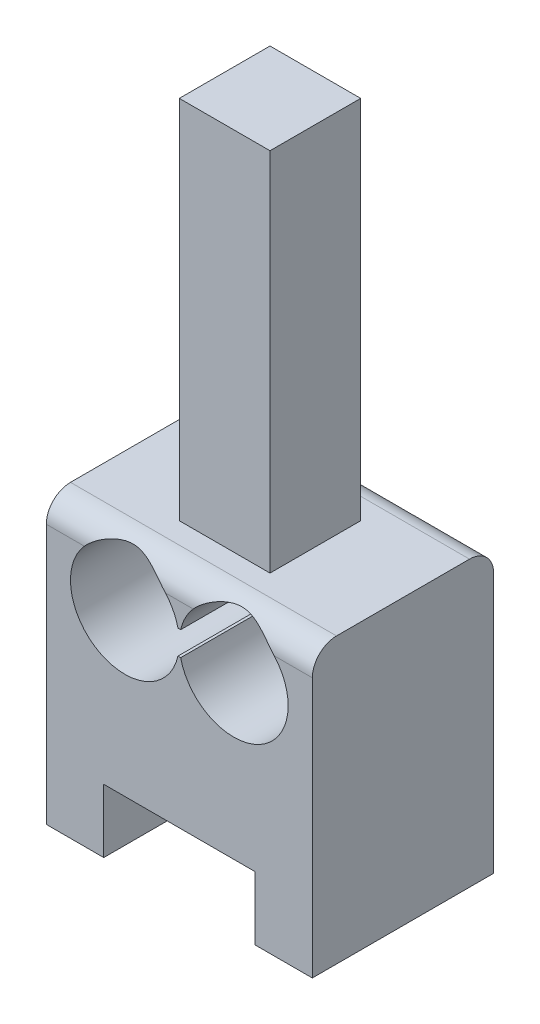
ISO-10303-21;
HEADER;
FILE_DESCRIPTION(('STEP AP214'),'2;1');
FILE_NAME('part.step','',(''),(''),'','','');
FILE_SCHEMA(('AUTOMOTIVE_DESIGN { 1 0 10303 214 1 1 1 1 }'));
ENDSEC;
DATA;
#1=APPLICATION_CONTEXT('core data for automotive mechanical design processes');
#2=APPLICATION_PROTOCOL_DEFINITION('international standard','automotive_design',2000,#1);
#3=PRODUCT_CONTEXT('',#1,'mechanical');
#4=PRODUCT('Part','Part','',(#3));
#5=PRODUCT_RELATED_PRODUCT_CATEGORY('part','',(#4));
#6=PRODUCT_DEFINITION_FORMATION('','',#4);
#7=PRODUCT_DEFINITION_CONTEXT('part definition',#1,'design');
#8=PRODUCT_DEFINITION('design','',#6,#7);
#9=PRODUCT_DEFINITION_SHAPE('','',#8);
#10=(LENGTH_UNIT() NAMED_UNIT(*) SI_UNIT(.MILLI.,.METRE.));
#11=(NAMED_UNIT(*) PLANE_ANGLE_UNIT() SI_UNIT($,.RADIAN.));
#12=(NAMED_UNIT(*) SI_UNIT($,.STERADIAN.) SOLID_ANGLE_UNIT());
#13=UNCERTAINTY_MEASURE_WITH_UNIT(LENGTH_MEASURE(1.E-05),#10,'distance_accuracy_value','');
#14=(GEOMETRIC_REPRESENTATION_CONTEXT(3) GLOBAL_UNCERTAINTY_ASSIGNED_CONTEXT((#13)) GLOBAL_UNIT_ASSIGNED_CONTEXT((#10,
#11,#12)) REPRESENTATION_CONTEXT('',''));
#15=CARTESIAN_POINT('',(0.,0.,0.));
#16=DIRECTION('',(0.,0.,1.));
#17=DIRECTION('',(1.,0.,0.));
#18=AXIS2_PLACEMENT_3D('',#15,#16,#17);
#19=CARTESIAN_POINT('',(0.,0.,15.));
#20=DIRECTION('',(0.,0.,1.));
#21=DIRECTION('',(1.,0.,0.));
#22=AXIS2_PLACEMENT_3D('',#19,#20,#21);
#23=PLANE('',#22);
#24=DIRECTION('',(0.,-1.,0.));
#25=VECTOR('',#24,1.);
#26=CARTESIAN_POINT('',(59.1668994407689,0.,15.));
#27=LINE('',#26,#25);
#28=CARTESIAN_POINT('',(59.1668994407689,-47.8774777520744,15.));
#29=VERTEX_POINT('',#28);
#30=CARTESIAN_POINT('',(59.166899440769,-69.3774777520745,15.));
#31=VERTEX_POINT('',#30);
#32=EDGE_CURVE('E257',#29,#31,#27,.T.);
#33=ORIENTED_EDGE('',*,*,#32,.F.);
#34=DIRECTION('',(1.,0.,0.));
#35=VECTOR('',#34,1.);
#36=CARTESIAN_POINT('',(0.,-47.8774777520745,15.));
#37=LINE('',#36,#35);
#38=CARTESIAN_POINT('',(56.0210014070186,-47.8774777520745,15.));
#39=VERTEX_POINT('',#38);
#40=EDGE_CURVE('E11',#29,#39,#37,.F.);
#41=ORIENTED_EDGE('',*,*,#40,.T.);
#42=CARTESIAN_POINT('',(52.6668994407689,-50.8774777520745,15.));
#43=DIRECTION('',(0.,0.,1.));
#44=DIRECTION('',(1.,0.,0.));
#45=AXIS2_PLACEMENT_3D('',#42,#43,#44);
#46=CIRCLE('',#45,4.50000000000001);
#47=CARTESIAN_POINT('',(48.2794172470729,-51.8774777520744,15.));
#48=VERTEX_POINT('',#47);
#49=EDGE_CURVE('E251',#48,#39,#46,.T.);
#50=ORIENTED_EDGE('',*,*,#49,.F.);
#51=DIRECTION('',(1.,0.,0.));
#52=VECTOR('',#51,1.);
#53=CARTESIAN_POINT('',(0.,-51.8774777520744,15.));
#54=LINE('',#53,#52);
#55=CARTESIAN_POINT('',(48.054381634465,-51.8774777520744,15.));
#56=VERTEX_POINT('',#55);
#57=EDGE_CURVE('E254',#56,#48,#54,.T.);
#58=ORIENTED_EDGE('',*,*,#57,.F.);
#59=CARTESIAN_POINT('',(43.6668994407689,-50.8774777520744,15.));
#60=DIRECTION('',(0.,0.,1.));
#61=DIRECTION('',(1.,0.,0.));
#62=AXIS2_PLACEMENT_3D('',#59,#60,#61);
#63=CIRCLE('',#62,4.5);
#64=CARTESIAN_POINT('',(40.3127974745193,-47.8774777520745,15.));
#65=VERTEX_POINT('',#64);
#66=EDGE_CURVE('E247',#65,#56,#63,.T.);
#67=ORIENTED_EDGE('',*,*,#66,.F.);
#68=DIRECTION('',(1.,0.,0.));
#69=VECTOR('',#68,1.);
#70=CARTESIAN_POINT('',(0.,-47.8774777520745,15.));
#71=LINE('',#70,#69);
#72=CARTESIAN_POINT('',(37.1668994407689,-47.8774777520745,15.));
#73=VERTEX_POINT('',#72);
#74=EDGE_CURVE('E59',#65,#73,#71,.F.);
#75=ORIENTED_EDGE('',*,*,#74,.T.);
#76=DIRECTION('',(0.,-1.,0.));
#77=VECTOR('',#76,1.);
#78=CARTESIAN_POINT('',(37.1668994407689,0.,15.));
#79=LINE('',#78,#77);
#80=CARTESIAN_POINT('',(37.1668994407689,-69.3774777520745,15.));
#81=VERTEX_POINT('',#80);
#82=EDGE_CURVE('E259',#73,#81,#79,.T.);
#83=ORIENTED_EDGE('',*,*,#82,.T.);
#84=DIRECTION('',(-1.,0.,0.));
#85=VECTOR('',#84,1.);
#86=CARTESIAN_POINT('',(0.,-69.3774777520745,15.));
#87=LINE('',#86,#85);
#88=CARTESIAN_POINT('',(41.9168994407689,-69.3774777520745,15.));
#89=VERTEX_POINT('',#88);
#90=EDGE_CURVE('E261',#89,#81,#87,.T.);
#91=ORIENTED_EDGE('',*,*,#90,.F.);
#92=DIRECTION('',(0.,-1.,0.));
#93=VECTOR('',#92,1.);
#94=CARTESIAN_POINT('',(41.9168994407689,0.,15.));
#95=LINE('',#94,#93);
#96=CARTESIAN_POINT('',(41.9168994407689,-64.1274777520745,15.));
#97=VERTEX_POINT('',#96);
#98=EDGE_CURVE('E264',#97,#89,#95,.T.);
#99=ORIENTED_EDGE('',*,*,#98,.F.);
#100=DIRECTION('',(1.,0.,0.));
#101=VECTOR('',#100,1.);
#102=CARTESIAN_POINT('',(0.,-64.1274777520745,15.));
#103=LINE('',#102,#101);
#104=CARTESIAN_POINT('',(54.4168994407689,-64.1274777520745,15.));
#105=VERTEX_POINT('',#104);
#106=EDGE_CURVE('E268',#97,#105,#103,.T.);
#107=ORIENTED_EDGE('',*,*,#106,.T.);
#108=DIRECTION('',(0.,-1.,0.));
#109=VECTOR('',#108,1.);
#110=CARTESIAN_POINT('',(54.4168994407689,0.,15.));
#111=LINE('',#110,#109);
#112=CARTESIAN_POINT('',(54.4168994407689,-69.3774777520745,15.));
#113=VERTEX_POINT('',#112);
#114=EDGE_CURVE('E271',#105,#113,#111,.T.);
#115=ORIENTED_EDGE('',*,*,#114,.T.);
#116=EDGE_CURVE('E265',#31,#113,#87,.T.);
#117=ORIENTED_EDGE('',*,*,#116,.F.);
#118=EDGE_LOOP('',(#33,#41,#50,#58,#67,#75,#83,#91,#99,#107,#115,#117));
#119=FACE_BOUND('',#118,.T.);
#120=ADVANCED_FACE('F43',(#119),#23,.T.);
#121=CARTESIAN_POINT('',(0.,0.,0.));
#122=DIRECTION('',(0.,0.,1.));
#123=DIRECTION('',(1.,0.,0.));
#124=AXIS2_PLACEMENT_3D('',#121,#122,#123);
#125=PLANE('',#124);
#126=DIRECTION('',(0.,-1.,0.));
#127=VECTOR('',#126,1.);
#128=CARTESIAN_POINT('',(37.1668994407689,0.,0.));
#129=LINE('',#128,#127);
#130=CARTESIAN_POINT('',(37.1668994407689,-47.8774777520745,0.));
#131=VERTEX_POINT('',#130);
#132=CARTESIAN_POINT('',(37.1668994407689,-69.3774777520745,0.));
#133=VERTEX_POINT('',#132);
#134=EDGE_CURVE('E288',#131,#133,#129,.T.);
#135=ORIENTED_EDGE('',*,*,#134,.F.);
#136=DIRECTION('',(1.,0.,0.));
#137=VECTOR('',#136,1.);
#138=CARTESIAN_POINT('',(59.1668994407689,-47.8774777520744,0.));
#139=LINE('',#138,#137);
#140=CARTESIAN_POINT('',(40.3127974745193,-47.8774777520745,0.));
#141=VERTEX_POINT('',#140);
#142=EDGE_CURVE('E336',#131,#141,#139,.T.);
#143=ORIENTED_EDGE('',*,*,#142,.T.);
#144=CARTESIAN_POINT('',(43.6668994407689,-50.8774777520744,0.));
#145=DIRECTION('',(0.,0.,1.));
#146=DIRECTION('',(1.,0.,0.));
#147=AXIS2_PLACEMENT_3D('',#144,#145,#146);
#148=CIRCLE('',#147,4.5);
#149=CARTESIAN_POINT('',(48.054381634465,-51.8774777520744,0.));
#150=VERTEX_POINT('',#149);
#151=EDGE_CURVE('E240',#141,#150,#148,.T.);
#152=ORIENTED_EDGE('',*,*,#151,.T.);
#153=DIRECTION('',(1.,0.,0.));
#154=VECTOR('',#153,1.);
#155=CARTESIAN_POINT('',(0.,-51.8774777520744,0.));
#156=LINE('',#155,#154);
#157=CARTESIAN_POINT('',(48.2794172470729,-51.8774777520744,0.));
#158=VERTEX_POINT('',#157);
#159=EDGE_CURVE('E283',#150,#158,#156,.T.);
#160=ORIENTED_EDGE('',*,*,#159,.T.);
#161=CARTESIAN_POINT('',(52.6668994407689,-50.8774777520745,0.));
#162=DIRECTION('',(0.,0.,1.));
#163=DIRECTION('',(1.,0.,0.));
#164=AXIS2_PLACEMENT_3D('',#161,#162,#163);
#165=CIRCLE('',#164,4.50000000000001);
#166=CARTESIAN_POINT('',(56.0210014070186,-47.8774777520745,0.));
#167=VERTEX_POINT('',#166);
#168=EDGE_CURVE('E280',#158,#167,#165,.T.);
#169=ORIENTED_EDGE('',*,*,#168,.T.);
#170=DIRECTION('',(1.,0.,0.));
#171=VECTOR('',#170,1.);
#172=CARTESIAN_POINT('',(59.1668994407689,-47.8774777520744,0.));
#173=LINE('',#172,#171);
#174=CARTESIAN_POINT('',(59.1668994407689,-47.8774777520744,0.));
#175=VERTEX_POINT('',#174);
#176=EDGE_CURVE('E323',#167,#175,#173,.T.);
#177=ORIENTED_EDGE('',*,*,#176,.T.);
#178=DIRECTION('',(0.,-1.,0.));
#179=VECTOR('',#178,1.);
#180=CARTESIAN_POINT('',(59.1668994407689,0.,0.));
#181=LINE('',#180,#179);
#182=CARTESIAN_POINT('',(59.166899440769,-69.3774777520745,0.));
#183=VERTEX_POINT('',#182);
#184=EDGE_CURVE('E286',#175,#183,#181,.T.);
#185=ORIENTED_EDGE('',*,*,#184,.T.);
#186=DIRECTION('',(-1.,0.,0.));
#187=VECTOR('',#186,1.);
#188=CARTESIAN_POINT('',(0.,-69.3774777520745,0.));
#189=LINE('',#188,#187);
#190=CARTESIAN_POINT('',(54.4168994407689,-69.3774777520745,0.));
#191=VERTEX_POINT('',#190);
#192=EDGE_CURVE('E294',#183,#191,#189,.T.);
#193=ORIENTED_EDGE('',*,*,#192,.T.);
#194=DIRECTION('',(0.,-1.,0.));
#195=VECTOR('',#194,1.);
#196=CARTESIAN_POINT('',(54.4168994407689,0.,0.));
#197=LINE('',#196,#195);
#198=CARTESIAN_POINT('',(54.4168994407689,-64.1274777520745,0.));
#199=VERTEX_POINT('',#198);
#200=EDGE_CURVE('E300',#199,#191,#197,.T.);
#201=ORIENTED_EDGE('',*,*,#200,.F.);
#202=DIRECTION('',(1.,0.,0.));
#203=VECTOR('',#202,1.);
#204=CARTESIAN_POINT('',(0.,-64.1274777520745,0.));
#205=LINE('',#204,#203);
#206=CARTESIAN_POINT('',(41.9168994407689,-64.1274777520745,0.));
#207=VERTEX_POINT('',#206);
#208=EDGE_CURVE('E297',#207,#199,#205,.T.);
#209=ORIENTED_EDGE('',*,*,#208,.F.);
#210=DIRECTION('',(0.,-1.,0.));
#211=VECTOR('',#210,1.);
#212=CARTESIAN_POINT('',(41.9168994407689,0.,0.));
#213=LINE('',#212,#211);
#214=CARTESIAN_POINT('',(41.9168994407689,-69.3774777520745,0.));
#215=VERTEX_POINT('',#214);
#216=EDGE_CURVE('E293',#207,#215,#213,.T.);
#217=ORIENTED_EDGE('',*,*,#216,.T.);
#218=EDGE_CURVE('E290',#215,#133,#189,.T.);
#219=ORIENTED_EDGE('',*,*,#218,.T.);
#220=EDGE_LOOP('',(#135,#143,#152,#160,#169,#177,#185,#193,#201,#209,#217,#219));
#221=FACE_BOUND('',#220,.T.);
#222=ADVANCED_FACE('F399',(#221),#125,.F.);
#223=CARTESIAN_POINT('',(0.,-45.8774777520745,15.));
#224=DIRECTION('',(0.,1.,0.));
#225=DIRECTION('',(-1.,0.,0.));
#226=AXIS2_PLACEMENT_3D('',#223,#224,#225);
#227=PLANE('',#226);
#228=DIRECTION('',(0.,0.,-1.));
#229=VECTOR('',#228,1.);
#230=CARTESIAN_POINT('',(59.1668994407689,-45.8774777520744,15.));
#231=LINE('',#230,#229);
#232=CARTESIAN_POINT('',(59.1668994407689,-45.8774777520744,13.));
#233=VERTEX_POINT('',#232);
#234=CARTESIAN_POINT('',(59.1668994407689,-45.8774777520744,2.));
#235=VERTEX_POINT('',#234);
#236=EDGE_CURVE('E321',#233,#235,#231,.T.);
#237=ORIENTED_EDGE('',*,*,#236,.T.);
#238=DIRECTION('',(1.,0.,0.));
#239=VECTOR('',#238,1.);
#240=CARTESIAN_POINT('',(37.1668994407689,-45.8774777520745,2.));
#241=LINE('',#240,#239);
#242=CARTESIAN_POINT('',(37.1668994407689,-45.8774777520744,2.));
#243=VERTEX_POINT('',#242);
#244=EDGE_CURVE('E67',#235,#243,#241,.F.);
#245=ORIENTED_EDGE('',*,*,#244,.T.);
#246=DIRECTION('',(0.,0.,-1.));
#247=VECTOR('',#246,1.);
#248=CARTESIAN_POINT('',(37.1668994407689,-45.8774777520744,15.));
#249=LINE('',#248,#247);
#250=CARTESIAN_POINT('',(37.1668994407689,-45.8774777520744,13.));
#251=VERTEX_POINT('',#250);
#252=EDGE_CURVE('E319',#251,#243,#249,.T.);
#253=ORIENTED_EDGE('',*,*,#252,.F.);
#254=DIRECTION('',(1.,0.,0.));
#255=VECTOR('',#254,1.);
#256=CARTESIAN_POINT('',(0.,-45.8774777520745,13.));
#257=LINE('',#256,#255);
#258=EDGE_CURVE('E492',#251,#233,#257,.T.);
#259=ORIENTED_EDGE('',*,*,#258,.T.);
#260=EDGE_LOOP('',(#237,#245,#253,#259));
#261=FACE_BOUND('',#260,.T.);
#262=DIRECTION('',(0.,0.,-1.));
#263=VECTOR('',#262,1.);
#264=CARTESIAN_POINT('',(44.4168994407689,-45.8774777520744,11.25));
#265=LINE('',#264,#263);
#266=CARTESIAN_POINT('',(44.4168994407689,-45.8774777520744,11.25));
#267=VERTEX_POINT('',#266);
#268=CARTESIAN_POINT('',(44.4168994407689,-45.8774777520744,3.75));
#269=VERTEX_POINT('',#268);
#270=EDGE_CURVE('E195',#267,#269,#265,.T.);
#271=ORIENTED_EDGE('',*,*,#270,.T.);
#272=DIRECTION('',(1.,0.,0.));
#273=VECTOR('',#272,1.);
#274=CARTESIAN_POINT('',(0.,-45.8774777520744,3.75));
#275=LINE('',#274,#273);
#276=CARTESIAN_POINT('',(51.916899440769,-45.8774777520744,3.75));
#277=VERTEX_POINT('',#276);
#278=EDGE_CURVE('E226',#269,#277,#275,.T.);
#279=ORIENTED_EDGE('',*,*,#278,.T.);
#280=DIRECTION('',(0.,0.,-1.));
#281=VECTOR('',#280,1.);
#282=CARTESIAN_POINT('',(51.916899440769,-45.8774777520744,11.25));
#283=LINE('',#282,#281);
#284=CARTESIAN_POINT('',(51.916899440769,-45.8774777520744,11.25));
#285=VERTEX_POINT('',#284);
#286=EDGE_CURVE('E206',#285,#277,#283,.T.);
#287=ORIENTED_EDGE('',*,*,#286,.F.);
#288=DIRECTION('',(1.,0.,0.));
#289=VECTOR('',#288,1.);
#290=CARTESIAN_POINT('',(0.,-45.8774777520744,11.25));
#291=LINE('',#290,#289);
#292=EDGE_CURVE('E210',#267,#285,#291,.T.);
#293=ORIENTED_EDGE('',*,*,#292,.F.);
#294=EDGE_LOOP('',(#271,#279,#287,#293));
#295=FACE_BOUND('',#294,.T.);
#296=ADVANCED_FACE('F218',(#261,#295),#227,.T.);
#297=CARTESIAN_POINT('',(59.1668994407689,0.,15.));
#298=DIRECTION('',(1.,0.,0.));
#299=DIRECTION('',(0.,1.,0.));
#300=AXIS2_PLACEMENT_3D('',#297,#298,#299);
#301=PLANE('',#300);
#302=ORIENTED_EDGE('',*,*,#184,.F.);
#303=CARTESIAN_POINT('',(59.1668994407689,-47.8774777520744,2.));
#304=DIRECTION('',(1.,0.,0.));
#305=DIRECTION('',(0.,1.,0.));
#306=AXIS2_PLACEMENT_3D('',#303,#304,#305);
#307=CIRCLE('',#306,2.);
#308=EDGE_CURVE('E493',#175,#235,#307,.T.);
#309=ORIENTED_EDGE('',*,*,#308,.T.);
#310=ORIENTED_EDGE('',*,*,#236,.F.);
#311=CARTESIAN_POINT('',(59.1668994407689,-47.8774777520744,13.));
#312=DIRECTION('',(1.,0.,0.));
#313=DIRECTION('',(0.,1.,0.));
#314=AXIS2_PLACEMENT_3D('',#311,#312,#313);
#315=CIRCLE('',#314,2.);
#316=EDGE_CURVE('E374',#233,#29,#315,.T.);
#317=ORIENTED_EDGE('',*,*,#316,.T.);
#318=ORIENTED_EDGE('',*,*,#32,.T.);
#319=DIRECTION('',(0.,0.,-1.));
#320=VECTOR('',#319,1.);
#321=CARTESIAN_POINT('',(59.166899440769,-69.3774777520745,15.));
#322=LINE('',#321,#320);
#323=EDGE_CURVE('E303',#31,#183,#322,.T.);
#324=ORIENTED_EDGE('',*,*,#323,.T.);
#325=EDGE_LOOP('',(#302,#309,#310,#317,#318,#324));
#326=FACE_BOUND('',#325,.T.);
#327=ADVANCED_FACE('F392',(#326),#301,.T.);
#328=CARTESIAN_POINT('',(37.1668994407689,0.,15.));
#329=DIRECTION('',(1.,0.,0.));
#330=DIRECTION('',(0.,0.,-1.));
#331=AXIS2_PLACEMENT_3D('',#328,#329,#330);
#332=PLANE('',#331);
#333=ORIENTED_EDGE('',*,*,#252,.T.);
#334=CARTESIAN_POINT('',(37.1668994407689,-47.8774777520745,2.));
#335=DIRECTION('',(1.,0.,0.));
#336=DIRECTION('',(0.,0.,-1.));
#337=AXIS2_PLACEMENT_3D('',#334,#335,#336);
#338=CIRCLE('',#337,2.);
#339=EDGE_CURVE('E486',#243,#131,#338,.F.);
#340=ORIENTED_EDGE('',*,*,#339,.T.);
#341=ORIENTED_EDGE('',*,*,#134,.T.);
#342=DIRECTION('',(0.,0.,-1.));
#343=VECTOR('',#342,1.);
#344=CARTESIAN_POINT('',(37.1668994407689,-69.3774777520745,15.));
#345=LINE('',#344,#343);
#346=EDGE_CURVE('E316',#81,#133,#345,.T.);
#347=ORIENTED_EDGE('',*,*,#346,.F.);
#348=ORIENTED_EDGE('',*,*,#82,.F.);
#349=CARTESIAN_POINT('',(37.1668994407689,-47.8774777520745,13.));
#350=DIRECTION('',(1.,0.,0.));
#351=DIRECTION('',(0.,0.,-1.));
#352=AXIS2_PLACEMENT_3D('',#349,#350,#351);
#353=CIRCLE('',#352,2.);
#354=EDGE_CURVE('E485',#73,#251,#353,.F.);
#355=ORIENTED_EDGE('',*,*,#354,.T.);
#356=EDGE_LOOP('',(#333,#340,#341,#347,#348,#355));
#357=FACE_BOUND('',#356,.T.);
#358=ADVANCED_FACE('F395',(#357),#332,.F.);
#359=CARTESIAN_POINT('',(0.,-69.3774777520745,15.));
#360=DIRECTION('',(0.,-1.,0.));
#361=DIRECTION('',(1.,0.,0.));
#362=AXIS2_PLACEMENT_3D('',#359,#360,#361);
#363=PLANE('',#362);
#364=ORIENTED_EDGE('',*,*,#218,.F.);
#365=DIRECTION('',(0.,0.,-1.));
#366=VECTOR('',#365,1.);
#367=CARTESIAN_POINT('',(41.9168994407689,-69.3774777520745,15.));
#368=LINE('',#367,#366);
#369=EDGE_CURVE('E314',#89,#215,#368,.T.);
#370=ORIENTED_EDGE('',*,*,#369,.F.);
#371=ORIENTED_EDGE('',*,*,#90,.T.);
#372=ORIENTED_EDGE('',*,*,#346,.T.);
#373=EDGE_LOOP('',(#364,#370,#371,#372));
#374=FACE_BOUND('',#373,.T.);
#375=ADVANCED_FACE('F402',(#374),#363,.T.);
#376=CARTESIAN_POINT('',(41.9168994407689,0.,15.));
#377=DIRECTION('',(1.,0.,0.));
#378=DIRECTION('',(0.,0.,-1.));
#379=AXIS2_PLACEMENT_3D('',#376,#377,#378);
#380=PLANE('',#379);
#381=ORIENTED_EDGE('',*,*,#216,.F.);
#382=DIRECTION('',(0.,0.,-1.));
#383=VECTOR('',#382,1.);
#384=CARTESIAN_POINT('',(41.9168994407689,-64.1274777520745,15.));
#385=LINE('',#384,#383);
#386=EDGE_CURVE('E312',#97,#207,#385,.T.);
#387=ORIENTED_EDGE('',*,*,#386,.F.);
#388=ORIENTED_EDGE('',*,*,#98,.T.);
#389=ORIENTED_EDGE('',*,*,#369,.T.);
#390=EDGE_LOOP('',(#381,#387,#388,#389));
#391=FACE_BOUND('',#390,.T.);
#392=ADVANCED_FACE('F404',(#391),#380,.T.);
#393=CARTESIAN_POINT('',(0.,-64.1274777520745,15.));
#394=DIRECTION('',(0.,1.,0.));
#395=DIRECTION('',(0.,0.,1.));
#396=AXIS2_PLACEMENT_3D('',#393,#394,#395);
#397=PLANE('',#396);
#398=CARTESIAN_POINT('',(48.166899440769,-64.1274777520745,7.5));
#399=DIRECTION('',(0.,-1.,0.));
#400=DIRECTION('',(0.,0.,-1.));
#401=AXIS2_PLACEMENT_3D('',#398,#399,#400);
#402=CIRCLE('',#401,1.95);
#403=CARTESIAN_POINT('',(48.166899440769,-64.1274777520745,5.55));
#404=VERTEX_POINT('',#403);
#405=EDGE_CURVE('E205',#404,#404,#402,.T.);
#406=ORIENTED_EDGE('',*,*,#405,.F.);
#407=EDGE_LOOP('',(#406));
#408=FACE_BOUND('',#407,.T.);
#409=ORIENTED_EDGE('',*,*,#208,.T.);
#410=DIRECTION('',(0.,0.,-1.));
#411=VECTOR('',#410,1.);
#412=CARTESIAN_POINT('',(54.4168994407689,-64.1274777520745,15.));
#413=LINE('',#412,#411);
#414=EDGE_CURVE('E309',#105,#199,#413,.T.);
#415=ORIENTED_EDGE('',*,*,#414,.F.);
#416=ORIENTED_EDGE('',*,*,#106,.F.);
#417=ORIENTED_EDGE('',*,*,#386,.T.);
#418=EDGE_LOOP('',(#409,#415,#416,#417));
#419=FACE_BOUND('',#418,.T.);
#420=ADVANCED_FACE('F407',(#408,#419),#397,.F.);
#421=CARTESIAN_POINT('',(54.4168994407689,0.,15.));
#422=DIRECTION('',(1.,0.,0.));
#423=DIRECTION('',(0.,0.,-1.));
#424=AXIS2_PLACEMENT_3D('',#421,#422,#423);
#425=PLANE('',#424);
#426=ORIENTED_EDGE('',*,*,#200,.T.);
#427=DIRECTION('',(0.,0.,-1.));
#428=VECTOR('',#427,1.);
#429=CARTESIAN_POINT('',(54.4168994407689,-69.3774777520745,15.));
#430=LINE('',#429,#428);
#431=EDGE_CURVE('E306',#113,#191,#430,.T.);
#432=ORIENTED_EDGE('',*,*,#431,.F.);
#433=ORIENTED_EDGE('',*,*,#114,.F.);
#434=ORIENTED_EDGE('',*,*,#414,.T.);
#435=EDGE_LOOP('',(#426,#432,#433,#434));
#436=FACE_BOUND('',#435,.T.);
#437=ADVANCED_FACE('F357',(#436),#425,.F.);
#438=CARTESIAN_POINT('',(43.6668994407689,-50.8774777520744,15.));
#439=DIRECTION('',(0.,0.,-1.));
#440=DIRECTION('',(-1.,0.,0.));
#441=AXIS2_PLACEMENT_3D('',#438,#439,#440);
#442=CYLINDRICAL_SURFACE('',#441,4.5);
#443=ORIENTED_EDGE('',*,*,#151,.F.);
#444=CARTESIAN_POINT('',(40.3127974745193,-47.8774777520745,0.));
#445=CARTESIAN_POINT('',(40.3695770512712,-47.813982609652,6.87269242451974E-06));
#446=CARTESIAN_POINT('',(40.4281227680986,-47.7521680933241,0.00302103317636042));
#447=CARTESIAN_POINT('',(40.5482811718406,-47.6322670523988,0.0141766034654785));
#448=CARTESIAN_POINT('',(40.6098888790073,-47.5741748051629,0.0223099239932667));
#449=CARTESIAN_POINT('',(40.7979246856929,-47.4065945326462,0.0529215407659409));
#450=CARTESIAN_POINT('',(40.9284426303704,-47.3028273843431,0.081638934622221));
#451=CARTESIAN_POINT('',(41.2692550225981,-47.0610432471496,0.167664109267686));
#452=CARTESIAN_POINT('',(41.485363572296,-46.9337690778355,0.232063963005091));
#453=CARTESIAN_POINT('',(41.8221282125811,-46.7710831385397,0.332668261137746));
#454=CARTESIAN_POINT('',(41.9368424286575,-46.7214539087449,0.366978183438591));
#455=CARTESIAN_POINT('',(42.1702997830475,-46.6317942253995,0.43430305303548));
#456=CARTESIAN_POINT('',(42.2890414082471,-46.5917602115038,0.46731847684538));
#457=CARTESIAN_POINT('',(42.5877434170362,-46.5048709447399,0.543733863087413));
#458=CARTESIAN_POINT('',(42.7701252182625,-46.4637272376342,0.584671810175554));
#459=CARTESIAN_POINT('',(43.0483310841739,-46.4192118818872,0.631089051793742));
#460=CARTESIAN_POINT('',(43.1415797480416,-46.4072494883098,0.644048166057547));
#461=CARTESIAN_POINT('',(43.3293029747777,-46.389169544637,0.663915065906235));
#462=CARTESIAN_POINT('',(43.4237773578396,-46.3830511468684,0.670823729098693));
#463=CARTESIAN_POINT('',(43.6138812304847,-46.3767778207657,0.677909204409197));
#464=CARTESIAN_POINT('',(43.7095140991231,-46.3766672396189,0.678035955184924));
#465=CARTESIAN_POINT('',(43.9003519896445,-46.3825233222193,0.671418363217986));
#466=CARTESIAN_POINT('',(43.9955569859899,-46.3884903439957,0.66467361567807));
#467=CARTESIAN_POINT('',(44.1852243116158,-46.4064081814908,0.644961603935387));
#468=CARTESIAN_POINT('',(44.2796804030651,-46.4183892692382,0.631962873958452));
#469=CARTESIAN_POINT('',(44.4668471576072,-46.448135682495,0.60091426072482));
#470=CARTESIAN_POINT('',(44.5595570462239,-46.4659035134806,0.582862190008388));
#471=CARTESIAN_POINT('',(44.7753057731853,-46.5142672760271,0.53604955323835));
#472=CARTESIAN_POINT('',(44.8974926399159,-46.5471775402852,0.505758664036033));
#473=CARTESIAN_POINT('',(45.1378571299406,-46.6228130362645,0.441708561991954));
#474=CARTESIAN_POINT('',(45.2560331191654,-46.6655422144983,0.407947957592932));
#475=CARTESIAN_POINT('',(45.4879812387608,-46.7605219760454,0.339935000091191));
#476=CARTESIAN_POINT('',(45.6017634759035,-46.8127489075674,0.305684059005789));
#477=CARTESIAN_POINT('',(45.8250416348745,-46.9267652482156,0.239175397230088));
#478=CARTESIAN_POINT('',(45.9345382218098,-46.9885531661022,0.206917366798919));
#479=CARTESIAN_POINT('',(46.1307339187162,-47.1104492629547,0.15193292160898));
#480=CARTESIAN_POINT('',(46.218158616266,-47.1690767903564,0.128516971321768));
#481=CARTESIAN_POINT('',(46.3893373605771,-47.2928602064494,0.0862349328288022));
#482=CARTESIAN_POINT('',(46.4730941338272,-47.3580111234928,0.0673654164690985));
#483=CARTESIAN_POINT('',(46.6370938960712,-47.4952541060297,0.0355901957269852));
#484=CARTESIAN_POINT('',(46.7173056052278,-47.5673948340282,0.0227305628983024));
#485=CARTESIAN_POINT('',(46.8729797262519,-47.7179101595191,0.00493657711954124));
#486=CARTESIAN_POINT('',(46.9484288950584,-47.7963008765582,2.34618529343177E-05));
#487=CARTESIAN_POINT('',(47.0210014070186,-47.8774777520744,0.));
#488=B_SPLINE_CURVE_WITH_KNOTS('',3,(#444,#445,#446,#447,#448,#449,#450,#451,#452,#453,#454,
#455,#456,#457,#458,#459,#460,#461,#462,#463,#464,#465,#466,#467,#468,#469,#470,#471,#472,#473,
#474,#475,#476,#477,#478,#479,#480,#481,#482,#483,#484,#485,#486,#487),.UNSPECIFIED.,.F.,.F.,(4,
2,2,2,2,2,2,2,2,2,2,2,2,2,2,2,2,2,2,2,2,4),(0.,0.255335533999291,0.510268597263111,
1.01624264819143,1.78868536284179,2.17721764196573,2.56560553059362,3.13746582900029,
3.42185925531437,3.70621142401335,3.99266227837148,4.27913000841202,4.56705436529181,
4.85510355037946,5.24488003905778,5.63481346532217,6.02378883518933,6.41270359709701,
6.73589575954195,7.05884345689397,7.38422781565405,7.71048036089905),.UNSPECIFIED.);
#489=CARTESIAN_POINT('',(47.0210014070186,-47.8774777520745,0.));
#490=VERTEX_POINT('',#489);
#491=EDGE_CURVE('E346',#141,#490,#488,.T.);
#492=ORIENTED_EDGE('',*,*,#491,.T.);
#493=CARTESIAN_POINT('',(48.054381634465,-49.8774777520744,0.));
#494=VERTEX_POINT('',#493);
#495=EDGE_CURVE('E273',#494,#490,#148,.T.);
#496=ORIENTED_EDGE('',*,*,#495,.F.);
#497=DIRECTION('',(0.,0.,-1.));
#498=VECTOR('',#497,1.);
#499=CARTESIAN_POINT('',(48.054381634465,-49.8774777520744,15.));
#500=LINE('',#499,#498);
#501=CARTESIAN_POINT('',(48.054381634465,-49.8774777520744,15.));
#502=VERTEX_POINT('',#501);
#503=EDGE_CURVE('E307',#502,#494,#500,.T.);
#504=ORIENTED_EDGE('',*,*,#503,.F.);
#505=CARTESIAN_POINT('',(47.0210014070186,-47.8774777520745,15.));
#506=VERTEX_POINT('',#505);
#507=EDGE_CURVE('E243',#502,#506,#63,.T.);
#508=ORIENTED_EDGE('',*,*,#507,.T.);
#509=CARTESIAN_POINT('',(47.0210014070186,-47.8774777520745,15.));
#510=CARTESIAN_POINT('',(46.9642218302667,-47.813982609652,14.9999931273076));
#511=CARTESIAN_POINT('',(46.9056761134393,-47.7521680933241,14.9969789668236));
#512=CARTESIAN_POINT('',(46.7855177096972,-47.6322670523988,14.9858233965345));
#513=CARTESIAN_POINT('',(46.7239100025306,-47.5741748051629,14.9776900760067));
#514=CARTESIAN_POINT('',(46.5358741958449,-47.4065945326462,14.9470784592341));
#515=CARTESIAN_POINT('',(46.4053562511674,-47.3028273843431,14.9183610653778));
#516=CARTESIAN_POINT('',(46.0645438589397,-47.0610432471496,14.8323358907323));
#517=CARTESIAN_POINT('',(45.8484353092418,-46.9337690778355,14.7679360369949));
#518=CARTESIAN_POINT('',(45.5116706689568,-46.7710831385397,14.6673317388623));
#519=CARTESIAN_POINT('',(45.3969564528804,-46.7214539087449,14.6330218165614));
#520=CARTESIAN_POINT('',(45.1634990984904,-46.6317942253995,14.5656969469645));
#521=CARTESIAN_POINT('',(45.0447574732908,-46.5917602115038,14.5326815231546));
#522=CARTESIAN_POINT('',(44.7460554645017,-46.5048709447399,14.4562661369126));
#523=CARTESIAN_POINT('',(44.5636736632754,-46.4637272376342,14.4153281898244));
#524=CARTESIAN_POINT('',(44.285467797364,-46.4192118818872,14.3689109482063));
#525=CARTESIAN_POINT('',(44.1922191334963,-46.4072494883098,14.3559518339425));
#526=CARTESIAN_POINT('',(44.0044959067602,-46.389169544637,14.3360849340938));
#527=CARTESIAN_POINT('',(43.9100215236983,-46.3830511468684,14.3291762709013));
#528=CARTESIAN_POINT('',(43.7199176510532,-46.3767778207657,14.3220907955908));
#529=CARTESIAN_POINT('',(43.6242847824147,-46.3766672396189,14.3219640448151));
#530=CARTESIAN_POINT('',(43.4334468918933,-46.3825233222193,14.328581636782));
#531=CARTESIAN_POINT('',(43.338241895548,-46.3884903439957,14.3353263843219));
#532=CARTESIAN_POINT('',(43.1485745699221,-46.4064081814908,14.3550383960646));
#533=CARTESIAN_POINT('',(43.0541184784728,-46.4183892692382,14.3680371260415));
#534=CARTESIAN_POINT('',(42.8669517239307,-46.448135682495,14.3990857392752));
#535=CARTESIAN_POINT('',(42.7742418353139,-46.4659035134806,14.4171378099916));
#536=CARTESIAN_POINT('',(42.5584931083525,-46.5142672760271,14.4639504467616));
#537=CARTESIAN_POINT('',(42.436306241622,-46.5471775402852,14.494241335964));
#538=CARTESIAN_POINT('',(42.1959417515973,-46.6228130362645,14.558291438008));
#539=CARTESIAN_POINT('',(42.0777657623725,-46.6655422144983,14.5920520424071));
#540=CARTESIAN_POINT('',(41.8458176427771,-46.7605219760454,14.6600649999088));
#541=CARTESIAN_POINT('',(41.7320354056343,-46.8127489075674,14.6943159409942));
#542=CARTESIAN_POINT('',(41.5087572466634,-46.9267652482156,14.7608246027699));
#543=CARTESIAN_POINT('',(41.399260659728,-46.9885531661022,14.7930826332011));
#544=CARTESIAN_POINT('',(41.2030649628217,-47.1104492629547,14.848067078391));
#545=CARTESIAN_POINT('',(41.1156402652719,-47.1690767903564,14.8714830286782));
#546=CARTESIAN_POINT('',(40.9444615209608,-47.2928602064494,14.9137650671712));
#547=CARTESIAN_POINT('',(40.8607047477107,-47.3580111234928,14.9326345835309));
#548=CARTESIAN_POINT('',(40.6967049854667,-47.4952541060297,14.964409804273));
#549=CARTESIAN_POINT('',(40.6164932763101,-47.5673948340282,14.9772694371017));
#550=CARTESIAN_POINT('',(40.460819155286,-47.7179101595191,14.9950634228805));
#551=CARTESIAN_POINT('',(40.3853699864795,-47.7963008765582,14.9999765381471));
#552=CARTESIAN_POINT('',(40.3127974745193,-47.8774777520744,15.));
#553=B_SPLINE_CURVE_WITH_KNOTS('',3,(#509,#510,#511,#512,#513,#514,#515,#516,#517,#518,#519,
#520,#521,#522,#523,#524,#525,#526,#527,#528,#529,#530,#531,#532,#533,#534,#535,#536,#537,#538,
#539,#540,#541,#542,#543,#544,#545,#546,#547,#548,#549,#550,#551,#552),.UNSPECIFIED.,.F.,.F.,(4,
2,2,2,2,2,2,2,2,2,2,2,2,2,2,2,2,2,2,2,2,4),(0.,0.255335533999291,0.510268597263111,
1.01624264819143,1.78868536284179,2.17721764196573,2.56560553059362,3.13746582900029,
3.42185925531437,3.70621142401335,3.99266227837147,4.27913000841202,4.56705436529181,
4.85510355037946,5.24488003905777,5.63481346532217,6.02378883518933,6.41270359709701,
6.73589575954195,7.05884345689397,7.38422781565405,7.71048036089905),.UNSPECIFIED.);
#554=EDGE_CURVE('E339',#506,#65,#553,.T.);
#555=ORIENTED_EDGE('',*,*,#554,.T.);
#556=ORIENTED_EDGE('',*,*,#66,.T.);
#557=DIRECTION('',(0.,0.,-1.));
#558=VECTOR('',#557,1.);
#559=CARTESIAN_POINT('',(48.054381634465,-51.8774777520744,15.));
#560=LINE('',#559,#558);
#561=EDGE_CURVE('E324',#56,#150,#560,.T.);
#562=ORIENTED_EDGE('',*,*,#561,.T.);
#563=EDGE_LOOP('',(#443,#492,#496,#504,#508,#555,#556,#562));
#564=FACE_BOUND('',#563,.T.);
#565=ADVANCED_FACE('F352',(#564),#442,.F.);
#566=CARTESIAN_POINT('',(0.,-49.8774777520744,15.));
#567=DIRECTION('',(0.,1.,0.));
#568=DIRECTION('',(0.,0.,1.));
#569=AXIS2_PLACEMENT_3D('',#566,#567,#568);
#570=PLANE('',#569);
#571=DIRECTION('',(1.,0.,0.));
#572=VECTOR('',#571,1.);
#573=CARTESIAN_POINT('',(0.,-49.8774777520744,0.));
#574=LINE('',#573,#572);
#575=CARTESIAN_POINT('',(48.2794172470729,-49.8774777520744,0.));
#576=VERTEX_POINT('',#575);
#577=EDGE_CURVE('E276',#494,#576,#574,.T.);
#578=ORIENTED_EDGE('',*,*,#577,.T.);
#579=DIRECTION('',(0.,0.,-1.));
#580=VECTOR('',#579,1.);
#581=CARTESIAN_POINT('',(48.2794172470729,-49.8774777520744,15.));
#582=LINE('',#581,#580);
#583=CARTESIAN_POINT('',(48.2794172470729,-49.8774777520744,15.));
#584=VERTEX_POINT('',#583);
#585=EDGE_CURVE('E329',#584,#576,#582,.T.);
#586=ORIENTED_EDGE('',*,*,#585,.F.);
#587=DIRECTION('',(1.,0.,0.));
#588=VECTOR('',#587,1.);
#589=CARTESIAN_POINT('',(0.,-49.8774777520744,15.));
#590=LINE('',#589,#588);
#591=EDGE_CURVE('E246',#502,#584,#590,.T.);
#592=ORIENTED_EDGE('',*,*,#591,.F.);
#593=ORIENTED_EDGE('',*,*,#503,.T.);
#594=EDGE_LOOP('',(#578,#586,#592,#593));
#595=FACE_BOUND('',#594,.T.);
#596=ADVANCED_FACE('F356',(#595),#570,.F.);
#597=CARTESIAN_POINT('',(52.6668994407689,-50.8774777520745,15.));
#598=DIRECTION('',(0.,0.,-1.));
#599=DIRECTION('',(-1.,0.,0.));
#600=AXIS2_PLACEMENT_3D('',#597,#598,#599);
#601=CYLINDRICAL_SURFACE('',#600,4.50000000000001);
#602=CARTESIAN_POINT('',(49.3127974745193,-47.8774777520745,0.));
#603=VERTEX_POINT('',#602);
#604=EDGE_CURVE('E279',#603,#576,#165,.T.);
#605=ORIENTED_EDGE('',*,*,#604,.F.);
#606=CARTESIAN_POINT('',(49.3127974745193,-47.8774777520745,0.));
#607=CARTESIAN_POINT('',(49.3695770512712,-47.813982609652,6.87269242455267E-06));
#608=CARTESIAN_POINT('',(49.4281227680986,-47.7521680933241,0.00302103317636036));
#609=CARTESIAN_POINT('',(49.5482811718406,-47.6322670523988,0.0141766034654783));
#610=CARTESIAN_POINT('',(49.6098888790073,-47.5741748051629,0.0223099239932666));
#611=CARTESIAN_POINT('',(49.7979246856929,-47.4065945326461,0.0529215407659408));
#612=CARTESIAN_POINT('',(49.9284426303704,-47.3028273843431,0.0816389346222207));
#613=CARTESIAN_POINT('',(50.2692550225981,-47.0610432471496,0.167664109267685));
#614=CARTESIAN_POINT('',(50.485363572296,-46.9337690778355,0.232063963005089));
#615=CARTESIAN_POINT('',(50.8221282125811,-46.7710831385397,0.332668261137741));
#616=CARTESIAN_POINT('',(50.9368424286575,-46.7214539087449,0.366978183438586));
#617=CARTESIAN_POINT('',(51.1702997830475,-46.6317942253994,0.434303053035475));
#618=CARTESIAN_POINT('',(51.2890414082471,-46.5917602115038,0.467318476845376));
#619=CARTESIAN_POINT('',(51.5877434170362,-46.5048709447399,0.543733863087409));
#620=CARTESIAN_POINT('',(51.7701252182625,-46.4637272376342,0.584671810175548));
#621=CARTESIAN_POINT('',(52.0483310841739,-46.4192118818872,0.631089051793737));
#622=CARTESIAN_POINT('',(52.1415797480416,-46.4072494883098,0.644048166057543));
#623=CARTESIAN_POINT('',(52.3293029747777,-46.389169544637,0.663915065906231));
#624=CARTESIAN_POINT('',(52.4237773578396,-46.3830511468684,0.670823729098688));
#625=CARTESIAN_POINT('',(52.6138812304847,-46.3767778207657,0.677909204409191));
#626=CARTESIAN_POINT('',(52.7095140991231,-46.3766672396189,0.678035955184919));
#627=CARTESIAN_POINT('',(52.9003519896445,-46.3825233222193,0.67141836321798));
#628=CARTESIAN_POINT('',(52.9955569859899,-46.3884903439957,0.664673615678064));
#629=CARTESIAN_POINT('',(53.1852243116158,-46.4064081814908,0.64496160393538));
#630=CARTESIAN_POINT('',(53.2796804030651,-46.4183892692382,0.631962873958445));
#631=CARTESIAN_POINT('',(53.4668471576072,-46.448135682495,0.600914260724813));
#632=CARTESIAN_POINT('',(53.5595570462239,-46.4659035134806,0.582862190008382));
#633=CARTESIAN_POINT('',(53.7753057731853,-46.5142672760271,0.536049553238345));
#634=CARTESIAN_POINT('',(53.8974926399159,-46.5471775402852,0.505758664036029));
#635=CARTESIAN_POINT('',(54.1378571299406,-46.6228130362645,0.441708561991951));
#636=CARTESIAN_POINT('',(54.2560331191654,-46.6655422144983,0.407947957592928));
#637=CARTESIAN_POINT('',(54.4879812387608,-46.7605219760454,0.339935000091187));
#638=CARTESIAN_POINT('',(54.6017634759035,-46.8127489075674,0.305684059005785));
#639=CARTESIAN_POINT('',(54.8250416348745,-46.9267652482156,0.239175397230083));
#640=CARTESIAN_POINT('',(54.9345382218098,-46.9885531661022,0.206917366798914));
#641=CARTESIAN_POINT('',(55.1307339187162,-47.1104492629547,0.151932921608975));
#642=CARTESIAN_POINT('',(55.218158616266,-47.1690767903564,0.128516971321764));
#643=CARTESIAN_POINT('',(55.3893373605771,-47.2928602064493,0.0862349328288011));
#644=CARTESIAN_POINT('',(55.4730941338272,-47.3580111234928,0.0673654164690983));
#645=CARTESIAN_POINT('',(55.6370938960712,-47.4952541060296,0.0355901957269852));
#646=CARTESIAN_POINT('',(55.7173056052278,-47.5673948340282,0.0227305628983021));
#647=CARTESIAN_POINT('',(55.8729797262519,-47.7179101595191,0.00493657711954114));
#648=CARTESIAN_POINT('',(55.9484288950584,-47.7963008765582,2.34618529343598E-05));
#649=CARTESIAN_POINT('',(56.0210014070186,-47.8774777520744,0.));
#650=B_SPLINE_CURVE_WITH_KNOTS('',3,(#606,#607,#608,#609,#610,#611,#612,#613,#614,#615,#616,
#617,#618,#619,#620,#621,#622,#623,#624,#625,#626,#627,#628,#629,#630,#631,#632,#633,#634,#635,
#636,#637,#638,#639,#640,#641,#642,#643,#644,#645,#646,#647,#648,#649),.UNSPECIFIED.,.F.,.F.,(4,
2,2,2,2,2,2,2,2,2,2,2,2,2,2,2,2,2,2,2,2,4),(0.,0.255335533999286,0.510268597263111,
1.01624264819143,1.78868536284178,2.17721764196573,2.56560553059362,3.13746582900029,
3.42185925531437,3.70621142401334,3.99266227837148,4.27913000841202,4.56705436529181,
4.85510355037946,5.24488003905778,5.63481346532217,6.02378883518934,6.41270359709702,
6.73589575954195,7.05884345689397,7.38422781565406,7.71048036089905),.UNSPECIFIED.);
#651=EDGE_CURVE('E368',#603,#167,#650,.T.);
#652=ORIENTED_EDGE('',*,*,#651,.T.);
#653=ORIENTED_EDGE('',*,*,#168,.F.);
#654=DIRECTION('',(0.,0.,-1.));
#655=VECTOR('',#654,1.);
#656=CARTESIAN_POINT('',(48.2794172470729,-51.8774777520744,15.));
#657=LINE('',#656,#655);
#658=EDGE_CURVE('E327',#48,#158,#657,.T.);
#659=ORIENTED_EDGE('',*,*,#658,.F.);
#660=ORIENTED_EDGE('',*,*,#49,.T.);
#661=CARTESIAN_POINT('',(56.0210014070186,-47.8774777520745,15.));
#662=CARTESIAN_POINT('',(55.9642218302667,-47.813982609652,14.9999931273076));
#663=CARTESIAN_POINT('',(55.9056761134393,-47.7521680933241,14.9969789668236));
#664=CARTESIAN_POINT('',(55.7855177096973,-47.6322670523988,14.9858233965345));
#665=CARTESIAN_POINT('',(55.7239100025306,-47.5741748051629,14.9776900760067));
#666=CARTESIAN_POINT('',(55.5358741958449,-47.4065945326461,14.9470784592341));
#667=CARTESIAN_POINT('',(55.4053562511675,-47.3028273843431,14.9183610653778));
#668=CARTESIAN_POINT('',(55.0645438589397,-47.0610432471496,14.8323358907323));
#669=CARTESIAN_POINT('',(54.8484353092418,-46.9337690778355,14.7679360369949));
#670=CARTESIAN_POINT('',(54.5116706689568,-46.7710831385397,14.6673317388623));
#671=CARTESIAN_POINT('',(54.3969564528804,-46.7214539087449,14.6330218165614));
#672=CARTESIAN_POINT('',(54.1634990984904,-46.6317942253994,14.5656969469645));
#673=CARTESIAN_POINT('',(54.0447574732908,-46.5917602115038,14.5326815231546));
#674=CARTESIAN_POINT('',(53.7460554645017,-46.5048709447399,14.4562661369126));
#675=CARTESIAN_POINT('',(53.5636736632754,-46.4637272376342,14.4153281898245));
#676=CARTESIAN_POINT('',(53.285467797364,-46.4192118818871,14.3689109482063));
#677=CARTESIAN_POINT('',(53.1922191334963,-46.4072494883098,14.3559518339425));
#678=CARTESIAN_POINT('',(53.0044959067602,-46.389169544637,14.3360849340938));
#679=CARTESIAN_POINT('',(52.9100215236983,-46.3830511468684,14.3291762709013));
#680=CARTESIAN_POINT('',(52.7199176510532,-46.3767778207657,14.3220907955908));
#681=CARTESIAN_POINT('',(52.6242847824147,-46.3766672396189,14.3219640448151));
#682=CARTESIAN_POINT('',(52.4334468918933,-46.3825233222193,14.328581636782));
#683=CARTESIAN_POINT('',(52.338241895548,-46.3884903439957,14.3353263843219));
#684=CARTESIAN_POINT('',(52.1485745699221,-46.4064081814908,14.3550383960646));
#685=CARTESIAN_POINT('',(52.0541184784728,-46.4183892692382,14.3680371260416));
#686=CARTESIAN_POINT('',(51.8669517239307,-46.448135682495,14.3990857392752));
#687=CARTESIAN_POINT('',(51.7742418353139,-46.4659035134806,14.4171378099916));
#688=CARTESIAN_POINT('',(51.5584931083525,-46.5142672760271,14.4639504467617));
#689=CARTESIAN_POINT('',(51.436306241622,-46.5471775402852,14.494241335964));
#690=CARTESIAN_POINT('',(51.1959417515973,-46.6228130362645,14.558291438008));
#691=CARTESIAN_POINT('',(51.0777657623725,-46.6655422144983,14.5920520424071));
#692=CARTESIAN_POINT('',(50.8458176427771,-46.7605219760455,14.6600649999088));
#693=CARTESIAN_POINT('',(50.7320354056343,-46.8127489075674,14.6943159409942));
#694=CARTESIAN_POINT('',(50.5087572466634,-46.9267652482156,14.7608246027699));
#695=CARTESIAN_POINT('',(50.399260659728,-46.9885531661022,14.7930826332011));
#696=CARTESIAN_POINT('',(50.2030649628217,-47.1104492629547,14.848067078391));
#697=CARTESIAN_POINT('',(50.1156402652719,-47.1690767903564,14.8714830286782));
#698=CARTESIAN_POINT('',(49.9444615209608,-47.2928602064494,14.9137650671712));
#699=CARTESIAN_POINT('',(49.8607047477107,-47.3580111234928,14.9326345835309));
#700=CARTESIAN_POINT('',(49.6967049854667,-47.4952541060297,14.964409804273));
#701=CARTESIAN_POINT('',(49.6164932763101,-47.5673948340282,14.9772694371017));
#702=CARTESIAN_POINT('',(49.460819155286,-47.7179101595191,14.9950634228805));
#703=CARTESIAN_POINT('',(49.3853699864795,-47.7963008765582,14.9999765381471));
#704=CARTESIAN_POINT('',(49.3127974745193,-47.8774777520744,15.));
#705=B_SPLINE_CURVE_WITH_KNOTS('',3,(#661,#662,#663,#664,#665,#666,#667,#668,#669,#670,#671,
#672,#673,#674,#675,#676,#677,#678,#679,#680,#681,#682,#683,#684,#685,#686,#687,#688,#689,#690,
#691,#692,#693,#694,#695,#696,#697,#698,#699,#700,#701,#702,#703,#704),.UNSPECIFIED.,.F.,.F.,(4,
2,2,2,2,2,2,2,2,2,2,2,2,2,2,2,2,2,2,2,2,4),(0.,0.255335533999286,0.510268597263101,
1.01624264819143,1.7886853628418,2.17721764196574,2.56560553059362,3.1374658290003,
3.42185925531437,3.70621142401335,3.99266227837148,4.27913000841203,4.56705436529181,
4.85510355037947,5.24488003905779,5.63481346532218,6.02378883518935,6.41270359709703,
6.73589575954195,7.05884345689398,7.38422781565406,7.71048036089905),.UNSPECIFIED.);
#706=CARTESIAN_POINT('',(49.3127974745193,-47.8774777520745,15.));
#707=VERTEX_POINT('',#706);
#708=EDGE_CURVE('E375',#39,#707,#705,.T.);
#709=ORIENTED_EDGE('',*,*,#708,.T.);
#710=EDGE_CURVE('E250',#707,#584,#46,.T.);
#711=ORIENTED_EDGE('',*,*,#710,.T.);
#712=ORIENTED_EDGE('',*,*,#585,.T.);
#713=EDGE_LOOP('',(#605,#652,#653,#659,#660,#709,#711,#712));
#714=FACE_BOUND('',#713,.T.);
#715=ADVANCED_FACE('F381',(#714),#601,.F.);
#716=CARTESIAN_POINT('',(0.,-51.8774777520744,15.));
#717=DIRECTION('',(0.,1.,0.));
#718=DIRECTION('',(0.,0.,1.));
#719=AXIS2_PLACEMENT_3D('',#716,#717,#718);
#720=PLANE('',#719);
#721=ORIENTED_EDGE('',*,*,#159,.F.);
#722=ORIENTED_EDGE('',*,*,#561,.F.);
#723=ORIENTED_EDGE('',*,*,#57,.T.);
#724=ORIENTED_EDGE('',*,*,#658,.T.);
#725=EDGE_LOOP('',(#721,#722,#723,#724));
#726=FACE_BOUND('',#725,.T.);
#727=ADVANCED_FACE('F385',(#726),#720,.T.);
#728=ORIENTED_EDGE('',*,*,#192,.F.);
#729=ORIENTED_EDGE('',*,*,#323,.F.);
#730=ORIENTED_EDGE('',*,*,#116,.T.);
#731=ORIENTED_EDGE('',*,*,#431,.T.);
#732=EDGE_LOOP('',(#728,#729,#730,#731));
#733=FACE_BOUND('',#732,.T.);
#734=ADVANCED_FACE('F390',(#733),#363,.T.);
#735=ORIENTED_EDGE('',*,*,#710,.F.);
#736=DIRECTION('',(1.,0.,0.));
#737=VECTOR('',#736,1.);
#738=CARTESIAN_POINT('',(0.,-47.8774777520745,15.));
#739=LINE('',#738,#737);
#740=EDGE_CURVE('E52',#707,#506,#739,.F.);
#741=ORIENTED_EDGE('',*,*,#740,.T.);
#742=ORIENTED_EDGE('',*,*,#507,.F.);
#743=ORIENTED_EDGE('',*,*,#591,.T.);
#744=EDGE_LOOP('',(#735,#741,#742,#743));
#745=FACE_BOUND('',#744,.T.);
#746=ADVANCED_FACE('F417',(#745),#23,.T.);
#747=ORIENTED_EDGE('',*,*,#495,.T.);
#748=DIRECTION('',(1.,0.,0.));
#749=VECTOR('',#748,1.);
#750=CARTESIAN_POINT('',(59.1668994407689,-47.8774777520744,0.));
#751=LINE('',#750,#749);
#752=EDGE_CURVE('E334',#490,#603,#751,.T.);
#753=ORIENTED_EDGE('',*,*,#752,.T.);
#754=ORIENTED_EDGE('',*,*,#604,.T.);
#755=ORIENTED_EDGE('',*,*,#577,.F.);
#756=EDGE_LOOP('',(#747,#753,#754,#755));
#757=FACE_BOUND('',#756,.T.);
#758=ADVANCED_FACE('F419',(#757),#125,.F.);
#759=CARTESIAN_POINT('',(48.166899440769,-56.6274777520745,7.5));
#760=DIRECTION('',(0.,-1.,0.));
#761=DIRECTION('',(0.,0.,-1.));
#762=AXIS2_PLACEMENT_3D('',#759,#760,#761);
#763=CYLINDRICAL_SURFACE('',#762,1.95);
#764=CARTESIAN_POINT('',(48.166899440769,-56.6274777520745,7.5));
#765=DIRECTION('',(0.,-1.,0.));
#766=DIRECTION('',(0.,0.,-1.));
#767=AXIS2_PLACEMENT_3D('',#764,#765,#766);
#768=CIRCLE('',#767,1.95);
#769=CARTESIAN_POINT('',(48.166899440769,-56.6274777520745,5.55));
#770=VERTEX_POINT('',#769);
#771=EDGE_CURVE('E237',#770,#770,#768,.T.);
#772=ORIENTED_EDGE('',*,*,#771,.F.);
#773=EDGE_LOOP('',(#772));
#774=FACE_BOUND('',#773,.T.);
#775=ORIENTED_EDGE('',*,*,#405,.T.);
#776=EDGE_LOOP('',(#775));
#777=FACE_BOUND('',#776,.T.);
#778=ADVANCED_FACE('F422',(#774,#777),#763,.F.);
#779=CARTESIAN_POINT('',(48.166899440769,-56.6274777520745,7.5));
#780=DIRECTION('',(0.,-1.,0.));
#781=DIRECTION('',(0.,0.,-1.));
#782=AXIS2_PLACEMENT_3D('',#779,#780,#781);
#783=PLANE('',#782);
#784=ORIENTED_EDGE('',*,*,#771,.T.);
#785=EDGE_LOOP('',(#784));
#786=FACE_BOUND('',#785,.T.);
#787=ADVANCED_FACE('F429',(#786),#783,.T.);
#788=CARTESIAN_POINT('',(44.4168994407689,0.,11.25));
#789=DIRECTION('',(-1.,0.,0.));
#790=DIRECTION('',(0.,-1.,0.));
#791=AXIS2_PLACEMENT_3D('',#788,#789,#790);
#792=PLANE('',#791);
#793=DIRECTION('',(0.,1.,0.));
#794=VECTOR('',#793,1.);
#795=CARTESIAN_POINT('',(44.4168994407689,0.,3.75));
#796=LINE('',#795,#794);
#797=CARTESIAN_POINT('',(44.416899440769,-15.6274777520744,3.75));
#798=VERTEX_POINT('',#797);
#799=EDGE_CURVE('E200',#269,#798,#796,.T.);
#800=ORIENTED_EDGE('',*,*,#799,.F.);
#801=ORIENTED_EDGE('',*,*,#270,.F.);
#802=DIRECTION('',(0.,1.,0.));
#803=VECTOR('',#802,1.);
#804=CARTESIAN_POINT('',(44.4168994407689,0.,11.25));
#805=LINE('',#804,#803);
#806=CARTESIAN_POINT('',(44.416899440769,-15.6274777520744,11.25));
#807=VERTEX_POINT('',#806);
#808=EDGE_CURVE('E198',#267,#807,#805,.T.);
#809=ORIENTED_EDGE('',*,*,#808,.T.);
#810=DIRECTION('',(0.,0.,-1.));
#811=VECTOR('',#810,1.);
#812=CARTESIAN_POINT('',(44.416899440769,-15.6274777520744,11.25));
#813=LINE('',#812,#811);
#814=EDGE_CURVE('E224',#807,#798,#813,.T.);
#815=ORIENTED_EDGE('',*,*,#814,.T.);
#816=EDGE_LOOP('',(#800,#801,#809,#815));
#817=FACE_BOUND('',#816,.T.);
#818=ADVANCED_FACE('F197',(#817),#792,.T.);
#819=CARTESIAN_POINT('',(51.916899440769,0.,11.25));
#820=DIRECTION('',(-1.,0.,0.));
#821=DIRECTION('',(0.,0.,1.));
#822=AXIS2_PLACEMENT_3D('',#819,#820,#821);
#823=PLANE('',#822);
#824=DIRECTION('',(0.,1.,0.));
#825=VECTOR('',#824,1.);
#826=CARTESIAN_POINT('',(51.916899440769,0.,3.75));
#827=LINE('',#826,#825);
#828=CARTESIAN_POINT('',(51.916899440769,-15.6274777520745,3.75));
#829=VERTEX_POINT('',#828);
#830=EDGE_CURVE('E228',#277,#829,#827,.T.);
#831=ORIENTED_EDGE('',*,*,#830,.T.);
#832=DIRECTION('',(0.,0.,-1.));
#833=VECTOR('',#832,1.);
#834=CARTESIAN_POINT('',(51.916899440769,-15.6274777520745,11.25));
#835=LINE('',#834,#833);
#836=CARTESIAN_POINT('',(51.916899440769,-15.6274777520745,11.25));
#837=VERTEX_POINT('',#836);
#838=EDGE_CURVE('E233',#837,#829,#835,.T.);
#839=ORIENTED_EDGE('',*,*,#838,.F.);
#840=DIRECTION('',(0.,1.,0.));
#841=VECTOR('',#840,1.);
#842=CARTESIAN_POINT('',(51.916899440769,0.,11.25));
#843=LINE('',#842,#841);
#844=EDGE_CURVE('E219',#285,#837,#843,.T.);
#845=ORIENTED_EDGE('',*,*,#844,.F.);
#846=ORIENTED_EDGE('',*,*,#286,.T.);
#847=EDGE_LOOP('',(#831,#839,#845,#846));
#848=FACE_BOUND('',#847,.T.);
#849=ADVANCED_FACE('F436',(#848),#823,.F.);
#850=CARTESIAN_POINT('',(0.,-15.6274777520744,11.25));
#851=DIRECTION('',(0.,-1.,0.));
#852=DIRECTION('',(1.,0.,0.));
#853=AXIS2_PLACEMENT_3D('',#850,#851,#852);
#854=PLANE('',#853);
#855=DIRECTION('',(-1.,0.,0.));
#856=VECTOR('',#855,1.);
#857=CARTESIAN_POINT('',(0.,-15.6274777520744,3.75));
#858=LINE('',#857,#856);
#859=EDGE_CURVE('E215',#829,#798,#858,.T.);
#860=ORIENTED_EDGE('',*,*,#859,.T.);
#861=ORIENTED_EDGE('',*,*,#814,.F.);
#862=DIRECTION('',(-1.,0.,0.));
#863=VECTOR('',#862,1.);
#864=CARTESIAN_POINT('',(0.,-15.6274777520744,11.25));
#865=LINE('',#864,#863);
#866=EDGE_CURVE('E213',#837,#807,#865,.T.);
#867=ORIENTED_EDGE('',*,*,#866,.F.);
#868=ORIENTED_EDGE('',*,*,#838,.T.);
#869=EDGE_LOOP('',(#860,#861,#867,#868));
#870=FACE_BOUND('',#869,.T.);
#871=ADVANCED_FACE('F439',(#870),#854,.F.);
#872=CARTESIAN_POINT('',(0.,0.,11.25));
#873=DIRECTION('',(0.,0.,1.));
#874=DIRECTION('',(1.,0.,0.));
#875=AXIS2_PLACEMENT_3D('',#872,#873,#874);
#876=PLANE('',#875);
#877=ORIENTED_EDGE('',*,*,#808,.F.);
#878=ORIENTED_EDGE('',*,*,#292,.T.);
#879=ORIENTED_EDGE('',*,*,#844,.T.);
#880=ORIENTED_EDGE('',*,*,#866,.T.);
#881=EDGE_LOOP('',(#877,#878,#879,#880));
#882=FACE_BOUND('',#881,.T.);
#883=ADVANCED_FACE('F209',(#882),#876,.T.);
#884=CARTESIAN_POINT('',(0.,0.,3.75));
#885=DIRECTION('',(0.,0.,1.));
#886=DIRECTION('',(1.,0.,0.));
#887=AXIS2_PLACEMENT_3D('',#884,#885,#886);
#888=PLANE('',#887);
#889=ORIENTED_EDGE('',*,*,#799,.T.);
#890=ORIENTED_EDGE('',*,*,#859,.F.);
#891=ORIENTED_EDGE('',*,*,#830,.F.);
#892=ORIENTED_EDGE('',*,*,#278,.F.);
#893=EDGE_LOOP('',(#889,#890,#891,#892));
#894=FACE_BOUND('',#893,.T.);
#895=ADVANCED_FACE('F364',(#894),#888,.F.);
#896=CARTESIAN_POINT('',(0.,-47.8774777520745,2.));
#897=DIRECTION('',(-1.,0.,0.));
#898=DIRECTION('',(0.,-1.,0.));
#899=AXIS2_PLACEMENT_3D('',#896,#897,#898);
#900=CYLINDRICAL_SURFACE('',#899,2.);
#901=ORIENTED_EDGE('',*,*,#339,.F.);
#902=ORIENTED_EDGE('',*,*,#244,.F.);
#903=ORIENTED_EDGE('',*,*,#308,.F.);
#904=ORIENTED_EDGE('',*,*,#176,.F.);
#905=ORIENTED_EDGE('',*,*,#651,.F.);
#906=ORIENTED_EDGE('',*,*,#752,.F.);
#907=ORIENTED_EDGE('',*,*,#491,.F.);
#908=ORIENTED_EDGE('',*,*,#142,.F.);
#909=EDGE_LOOP('',(#901,#902,#903,#904,#905,#906,#907,#908));
#910=FACE_BOUND('',#909,.T.);
#911=ADVANCED_FACE('F360',(#910),#900,.T.);
#912=CARTESIAN_POINT('',(0.,-47.8774777520745,13.));
#913=DIRECTION('',(1.,0.,0.));
#914=DIRECTION('',(0.,1.,0.));
#915=AXIS2_PLACEMENT_3D('',#912,#913,#914);
#916=CYLINDRICAL_SURFACE('',#915,2.);
#917=ORIENTED_EDGE('',*,*,#708,.F.);
#918=ORIENTED_EDGE('',*,*,#40,.F.);
#919=ORIENTED_EDGE('',*,*,#316,.F.);
#920=ORIENTED_EDGE('',*,*,#258,.F.);
#921=ORIENTED_EDGE('',*,*,#354,.F.);
#922=ORIENTED_EDGE('',*,*,#74,.F.);
#923=ORIENTED_EDGE('',*,*,#554,.F.);
#924=ORIENTED_EDGE('',*,*,#740,.F.);
#925=EDGE_LOOP('',(#917,#918,#919,#920,#921,#922,#923,#924));
#926=FACE_BOUND('',#925,.T.);
#927=ADVANCED_FACE('F45',(#926),#916,.T.);
#928=CLOSED_SHELL('',(#120,#222,#296,#327,#358,#375,#392,#420,#437,#565,#596,#715,#727,#734,
#746,#758,#778,#787,#818,#849,#871,#883,#895,#911,#927));
#929=MANIFOLD_SOLID_BREP('B2',#928);
#930=ADVANCED_BREP_SHAPE_REPRESENTATION('',(#18,#929),#14);
#931=SHAPE_DEFINITION_REPRESENTATION(#9,#930);
ENDSEC;
END-ISO-10303-21;
